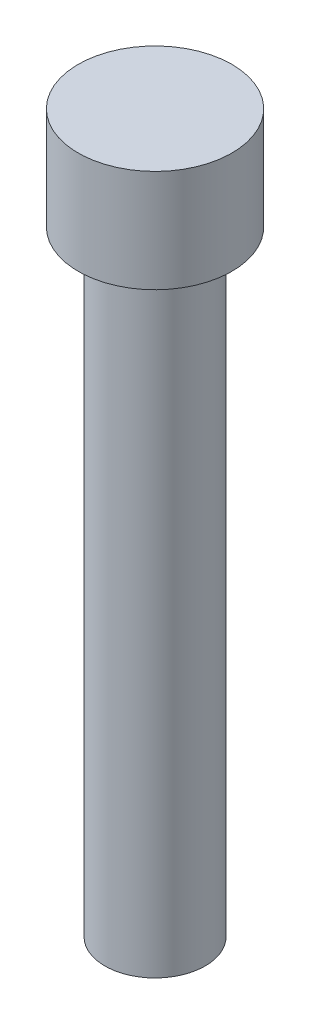
ISO-10303-21;
HEADER;
FILE_DESCRIPTION(('STEP AP214'),'2;1');
FILE_NAME('part.step','',(''),(''),'','','');
FILE_SCHEMA(('AUTOMOTIVE_DESIGN { 1 0 10303 214 1 1 1 1 }'));
ENDSEC;
DATA;
#1=APPLICATION_CONTEXT('core data for automotive mechanical design processes');
#2=APPLICATION_PROTOCOL_DEFINITION('international standard','automotive_design',2000,#1);
#3=PRODUCT_CONTEXT('',#1,'mechanical');
#4=PRODUCT('Part','Part','',(#3));
#5=PRODUCT_RELATED_PRODUCT_CATEGORY('part','',(#4));
#6=PRODUCT_DEFINITION_FORMATION('','',#4);
#7=PRODUCT_DEFINITION_CONTEXT('part definition',#1,'design');
#8=PRODUCT_DEFINITION('design','',#6,#7);
#9=PRODUCT_DEFINITION_SHAPE('','',#8);
#10=(LENGTH_UNIT() NAMED_UNIT(*) SI_UNIT(.MILLI.,.METRE.));
#11=(NAMED_UNIT(*) PLANE_ANGLE_UNIT() SI_UNIT($,.RADIAN.));
#12=(NAMED_UNIT(*) SI_UNIT($,.STERADIAN.) SOLID_ANGLE_UNIT());
#13=UNCERTAINTY_MEASURE_WITH_UNIT(LENGTH_MEASURE(1.E-05),#10,'distance_accuracy_value','');
#14=(GEOMETRIC_REPRESENTATION_CONTEXT(3) GLOBAL_UNCERTAINTY_ASSIGNED_CONTEXT((#13)) GLOBAL_UNIT_ASSIGNED_CONTEXT((#10,
#11,#12)) REPRESENTATION_CONTEXT('',''));
#15=CARTESIAN_POINT('',(0.,0.,0.));
#16=DIRECTION('',(0.,0.,1.));
#17=DIRECTION('',(1.,0.,0.));
#18=AXIS2_PLACEMENT_3D('',#15,#16,#17);
#19=CARTESIAN_POINT('',(0.,44.45,0.));
#20=DIRECTION('',(0.,-1.,0.));
#21=DIRECTION('',(0.,0.,-1.));
#22=AXIS2_PLACEMENT_3D('',#19,#20,#21);
#23=CYLINDRICAL_SURFACE('',#22,4.7625);
#24=CARTESIAN_POINT('',(0.,44.45,0.));
#25=DIRECTION('',(0.,-1.,0.));
#26=DIRECTION('',(0.,0.,-1.));
#27=AXIS2_PLACEMENT_3D('',#24,#25,#26);
#28=CIRCLE('',#27,4.7625);
#29=CARTESIAN_POINT('',(0.,44.45,-4.7625));
#30=VERTEX_POINT('',#29);
#31=EDGE_CURVE('E10',#30,#30,#28,.T.);
#32=ORIENTED_EDGE('',*,*,#31,.T.);
#33=EDGE_LOOP('',(#32));
#34=FACE_BOUND('',#33,.T.);
#35=CARTESIAN_POINT('',(0.,38.1,0.));
#36=DIRECTION('',(0.,-1.,0.));
#37=DIRECTION('',(0.,0.,-1.));
#38=AXIS2_PLACEMENT_3D('',#35,#36,#37);
#39=CIRCLE('',#38,4.7625);
#40=CARTESIAN_POINT('',(0.,38.1,-4.7625));
#41=VERTEX_POINT('',#40);
#42=EDGE_CURVE('E58',#41,#41,#39,.T.);
#43=ORIENTED_EDGE('',*,*,#42,.F.);
#44=EDGE_LOOP('',(#43));
#45=FACE_BOUND('',#44,.T.);
#46=ADVANCED_FACE('F41',(#34,#45),#23,.T.);
#47=CARTESIAN_POINT('',(4.7625,44.45,0.));
#48=DIRECTION('',(0.,1.,0.));
#49=DIRECTION('',(0.,0.,1.));
#50=AXIS2_PLACEMENT_3D('',#47,#48,#49);
#51=PLANE('',#50);
#52=ORIENTED_EDGE('',*,*,#31,.F.);
#53=EDGE_LOOP('',(#52));
#54=FACE_BOUND('',#53,.T.);
#55=ADVANCED_FACE('F69',(#54),#51,.T.);
#56=CARTESIAN_POINT('',(0.,0.,0.));
#57=DIRECTION('',(0.,-1.,0.));
#58=DIRECTION('',(0.,0.,-1.));
#59=AXIS2_PLACEMENT_3D('',#56,#57,#58);
#60=PLANE('',#59);
#61=CARTESIAN_POINT('',(0.,0.,0.));
#62=DIRECTION('',(0.,-1.,0.));
#63=DIRECTION('',(0.,0.,-1.));
#64=AXIS2_PLACEMENT_3D('',#61,#62,#63);
#65=CIRCLE('',#64,3.1115);
#66=CARTESIAN_POINT('',(0.,0.,-3.1115));
#67=VERTEX_POINT('',#66);
#68=EDGE_CURVE('E48',#67,#67,#65,.T.);
#69=ORIENTED_EDGE('',*,*,#68,.T.);
#70=EDGE_LOOP('',(#69));
#71=FACE_BOUND('',#70,.T.);
#72=ADVANCED_FACE('F73',(#71),#60,.T.);
#73=CARTESIAN_POINT('',(0.,44.45,0.));
#74=DIRECTION('',(0.,-1.,0.));
#75=DIRECTION('',(0.,0.,-1.));
#76=AXIS2_PLACEMENT_3D('',#73,#74,#75);
#77=CYLINDRICAL_SURFACE('',#76,3.1115);
#78=CARTESIAN_POINT('',(0.,38.1,0.));
#79=DIRECTION('',(0.,-1.,0.));
#80=DIRECTION('',(0.,0.,-1.));
#81=AXIS2_PLACEMENT_3D('',#78,#79,#80);
#82=CIRCLE('',#81,3.1115);
#83=CARTESIAN_POINT('',(0.,38.1,-3.1115));
#84=VERTEX_POINT('',#83);
#85=EDGE_CURVE('E53',#84,#84,#82,.T.);
#86=ORIENTED_EDGE('',*,*,#85,.T.);
#87=EDGE_LOOP('',(#86));
#88=FACE_BOUND('',#87,.T.);
#89=ORIENTED_EDGE('',*,*,#68,.F.);
#90=EDGE_LOOP('',(#89));
#91=FACE_BOUND('',#90,.T.);
#92=ADVANCED_FACE('F78',(#88,#91),#77,.T.);
#93=CARTESIAN_POINT('',(3.1115,38.1,0.));
#94=DIRECTION('',(0.,-1.,0.));
#95=DIRECTION('',(0.,0.,-1.));
#96=AXIS2_PLACEMENT_3D('',#93,#94,#95);
#97=PLANE('',#96);
#98=ORIENTED_EDGE('',*,*,#42,.T.);
#99=EDGE_LOOP('',(#98));
#100=FACE_BOUND('',#99,.T.);
#101=ORIENTED_EDGE('',*,*,#85,.F.);
#102=EDGE_LOOP('',(#101));
#103=FACE_BOUND('',#102,.T.);
#104=ADVANCED_FACE('F65',(#100,#103),#97,.T.);
#105=CLOSED_SHELL('',(#46,#55,#72,#92,#104));
#106=MANIFOLD_SOLID_BREP('B2',#105);
#107=ADVANCED_BREP_SHAPE_REPRESENTATION('',(#18,#106),#14);
#108=SHAPE_DEFINITION_REPRESENTATION(#9,#107);
ENDSEC;
END-ISO-10303-21;
